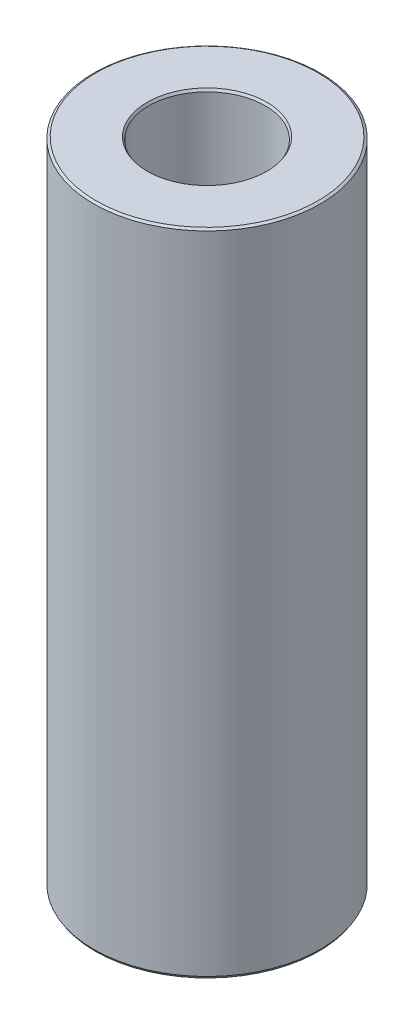
ISO-10303-21;
HEADER;
FILE_DESCRIPTION(('STEP AP214'),'2;1');
FILE_NAME('part.step','',(''),(''),'','','');
FILE_SCHEMA(('AUTOMOTIVE_DESIGN { 1 0 10303 214 1 1 1 1 }'));
ENDSEC;
DATA;
#1=APPLICATION_CONTEXT('core data for automotive mechanical design processes');
#2=APPLICATION_PROTOCOL_DEFINITION('international standard','automotive_design',2000,#1);
#3=PRODUCT_CONTEXT('',#1,'mechanical');
#4=PRODUCT('Part','Part','',(#3));
#5=PRODUCT_RELATED_PRODUCT_CATEGORY('part','',(#4));
#6=PRODUCT_DEFINITION_FORMATION('','',#4);
#7=PRODUCT_DEFINITION_CONTEXT('part definition',#1,'design');
#8=PRODUCT_DEFINITION('design','',#6,#7);
#9=PRODUCT_DEFINITION_SHAPE('','',#8);
#10=(LENGTH_UNIT() NAMED_UNIT(*) SI_UNIT(.MILLI.,.METRE.));
#11=(NAMED_UNIT(*) PLANE_ANGLE_UNIT() SI_UNIT($,.RADIAN.));
#12=(NAMED_UNIT(*) SI_UNIT($,.STERADIAN.) SOLID_ANGLE_UNIT());
#13=UNCERTAINTY_MEASURE_WITH_UNIT(LENGTH_MEASURE(1.E-05),#10,'distance_accuracy_value','');
#14=(GEOMETRIC_REPRESENTATION_CONTEXT(3) GLOBAL_UNCERTAINTY_ASSIGNED_CONTEXT((#13)) GLOBAL_UNIT_ASSIGNED_CONTEXT((#10,
#11,#12)) REPRESENTATION_CONTEXT('',''));
#15=CARTESIAN_POINT('',(0.,0.,0.));
#16=DIRECTION('',(0.,0.,1.));
#17=DIRECTION('',(1.,0.,0.));
#18=AXIS2_PLACEMENT_3D('',#15,#16,#17);
#19=CARTESIAN_POINT('',(0.,315.169408489033,0.));
#20=DIRECTION('',(0.,-1.,0.));
#21=DIRECTION('',(0.,0.,-1.));
#22=AXIS2_PLACEMENT_3D('',#19,#20,#21);
#23=CYLINDRICAL_SURFACE('',#22,55.);
#24=CARTESIAN_POINT('',(0.,1.15574677775504,0.));
#25=DIRECTION('',(0.,1.,0.));
#26=DIRECTION('',(0.,0.,1.));
#27=AXIS2_PLACEMENT_3D('',#24,#25,#26);
#28=CIRCLE('',#27,55.);
#29=CARTESIAN_POINT('',(0.,1.15574677775504,55.));
#30=VERTEX_POINT('',#29);
#31=EDGE_CURVE('E10',#30,#30,#28,.T.);
#32=ORIENTED_EDGE('',*,*,#31,.T.);
#33=EDGE_LOOP('',(#32));
#34=FACE_BOUND('',#33,.T.);
#35=CARTESIAN_POINT('',(0.,314.443020853433,0.));
#36=DIRECTION('',(0.,1.,0.));
#37=DIRECTION('',(0.,0.,1.));
#38=AXIS2_PLACEMENT_3D('',#35,#36,#37);
#39=CIRCLE('',#38,55.);
#40=CARTESIAN_POINT('',(0.,314.443020853433,55.));
#41=VERTEX_POINT('',#40);
#42=EDGE_CURVE('E50',#41,#41,#39,.F.);
#43=ORIENTED_EDGE('',*,*,#42,.T.);
#44=EDGE_LOOP('',(#43));
#45=FACE_BOUND('',#44,.T.);
#46=ADVANCED_FACE('F39',(#34,#45),#23,.T.);
#47=CARTESIAN_POINT('',(0.,315.169408489033,0.));
#48=DIRECTION('',(0.,1.,0.));
#49=DIRECTION('',(0.,0.,1.));
#50=AXIS2_PLACEMENT_3D('',#47,#48,#49);
#51=PLANE('',#50);
#52=CARTESIAN_POINT('',(0.,315.169408489033,0.));
#53=DIRECTION('',(0.,1.,0.));
#54=DIRECTION('',(0.,0.,1.));
#55=AXIS2_PLACEMENT_3D('',#52,#53,#54);
#56=CIRCLE('',#55,29.0378739717565);
#57=CARTESIAN_POINT('',(0.,315.169408489033,29.0378739717565));
#58=VERTEX_POINT('',#57);
#59=EDGE_CURVE('E58',#58,#58,#56,.F.);
#60=ORIENTED_EDGE('',*,*,#59,.T.);
#61=EDGE_LOOP('',(#60));
#62=FACE_BOUND('',#61,.T.);
#63=CARTESIAN_POINT('',(0.,315.169408489033,0.));
#64=DIRECTION('',(0.,1.,0.));
#65=DIRECTION('',(0.,0.,1.));
#66=AXIS2_PLACEMENT_3D('',#63,#64,#65);
#67=CIRCLE('',#66,53.844253222245);
#68=CARTESIAN_POINT('',(0.,315.169408489033,53.844253222245));
#69=VERTEX_POINT('',#68);
#70=EDGE_CURVE('E61',#69,#69,#67,.T.);
#71=ORIENTED_EDGE('',*,*,#70,.T.);
#72=EDGE_LOOP('',(#71));
#73=FACE_BOUND('',#72,.T.);
#74=ADVANCED_FACE('F88',(#62,#73),#51,.T.);
#75=CARTESIAN_POINT('',(0.,0.,0.));
#76=DIRECTION('',(0.,1.,0.));
#77=DIRECTION('',(0.,0.,1.));
#78=AXIS2_PLACEMENT_3D('',#75,#76,#77);
#79=PLANE('',#78);
#80=CARTESIAN_POINT('',(0.,0.,0.));
#81=DIRECTION('',(0.,1.,0.));
#82=DIRECTION('',(0.,0.,1.));
#83=AXIS2_PLACEMENT_3D('',#80,#81,#82);
#84=CIRCLE('',#83,29.4672331139111);
#85=CARTESIAN_POINT('',(0.,0.,29.4672331139111));
#86=VERTEX_POINT('',#85);
#87=EDGE_CURVE('E51',#86,#86,#84,.T.);
#88=ORIENTED_EDGE('',*,*,#87,.T.);
#89=EDGE_LOOP('',(#88));
#90=FACE_BOUND('',#89,.T.);
#91=CARTESIAN_POINT('',(0.,0.,0.));
#92=DIRECTION('',(0.,1.,0.));
#93=DIRECTION('',(0.,0.,1.));
#94=AXIS2_PLACEMENT_3D('',#91,#92,#93);
#95=CIRCLE('',#94,54.2736123643995);
#96=CARTESIAN_POINT('',(0.,0.,54.2736123643995));
#97=VERTEX_POINT('',#96);
#98=EDGE_CURVE('E54',#97,#97,#95,.F.);
#99=ORIENTED_EDGE('',*,*,#98,.T.);
#100=EDGE_LOOP('',(#99));
#101=FACE_BOUND('',#100,.T.);
#102=ADVANCED_FACE('F83',(#90,#101),#79,.F.);
#103=CARTESIAN_POINT('',(0.,315.169408489033,0.));
#104=DIRECTION('',(0.,-1.,0.));
#105=DIRECTION('',(0.,0.,-1.));
#106=AXIS2_PLACEMENT_3D('',#103,#104,#105);
#107=CYLINDRICAL_SURFACE('',#106,28.3114863361561);
#108=CARTESIAN_POINT('',(0.,314.013661711278,0.));
#109=DIRECTION('',(0.,1.,0.));
#110=DIRECTION('',(0.,0.,1.));
#111=AXIS2_PLACEMENT_3D('',#108,#109,#110);
#112=CIRCLE('',#111,28.3114863361561);
#113=CARTESIAN_POINT('',(0.,314.013661711278,28.3114863361561));
#114=VERTEX_POINT('',#113);
#115=EDGE_CURVE('E67',#114,#114,#112,.T.);
#116=ORIENTED_EDGE('',*,*,#115,.T.);
#117=EDGE_LOOP('',(#116));
#118=FACE_BOUND('',#117,.T.);
#119=CARTESIAN_POINT('',(0.,0.726387635600512,0.));
#120=DIRECTION('',(0.,1.,0.));
#121=DIRECTION('',(0.,0.,1.));
#122=AXIS2_PLACEMENT_3D('',#119,#120,#121);
#123=CIRCLE('',#122,28.3114863361561);
#124=CARTESIAN_POINT('',(0.,0.726387635600512,28.3114863361561));
#125=VERTEX_POINT('',#124);
#126=EDGE_CURVE('E69',#125,#125,#123,.F.);
#127=ORIENTED_EDGE('',*,*,#126,.T.);
#128=EDGE_LOOP('',(#127));
#129=FACE_BOUND('',#128,.T.);
#130=ADVANCED_FACE('F71',(#118,#129),#107,.F.);
#131=CARTESIAN_POINT('',(0.,314.013661711278,0.));
#132=DIRECTION('',(0.,1.,0.));
#133=DIRECTION('',(0.,0.,1.));
#134=AXIS2_PLACEMENT_3D('',#131,#132,#133);
#135=CONICAL_SURFACE('',#134,28.3114863361561,0.561112698481098);
#136=ORIENTED_EDGE('',*,*,#59,.F.);
#137=EDGE_LOOP('',(#136));
#138=FACE_BOUND('',#137,.T.);
#139=ORIENTED_EDGE('',*,*,#115,.F.);
#140=EDGE_LOOP('',(#139));
#141=FACE_BOUND('',#140,.T.);
#142=ADVANCED_FACE('F77',(#138,#141),#135,.F.);
#143=CARTESIAN_POINT('',(0.,0.,0.));
#144=DIRECTION('',(0.,-1.,0.));
#145=DIRECTION('',(0.,0.,-1.));
#146=AXIS2_PLACEMENT_3D('',#143,#144,#145);
#147=CONICAL_SURFACE('',#146,29.4672331139111,1.00968362831378);
#148=ORIENTED_EDGE('',*,*,#126,.F.);
#149=EDGE_LOOP('',(#148));
#150=FACE_BOUND('',#149,.T.);
#151=ORIENTED_EDGE('',*,*,#87,.F.);
#152=EDGE_LOOP('',(#151));
#153=FACE_BOUND('',#152,.T.);
#154=ADVANCED_FACE('F73',(#150,#153),#147,.F.);
#155=CARTESIAN_POINT('',(0.,1.15574677775504,0.));
#156=DIRECTION('',(0.,1.,0.));
#157=DIRECTION('',(0.,0.,1.));
#158=AXIS2_PLACEMENT_3D('',#155,#156,#157);
#159=CONICAL_SURFACE('',#158,55.,0.561112698481115);
#160=ORIENTED_EDGE('',*,*,#98,.F.);
#161=EDGE_LOOP('',(#160));
#162=FACE_BOUND('',#161,.T.);
#163=ORIENTED_EDGE('',*,*,#31,.F.);
#164=EDGE_LOOP('',(#163));
#165=FACE_BOUND('',#164,.T.);
#166=ADVANCED_FACE('F76',(#162,#165),#159,.T.);
#167=CARTESIAN_POINT('',(0.,315.169408489033,0.));
#168=DIRECTION('',(0.,-1.,0.));
#169=DIRECTION('',(0.,0.,-1.));
#170=AXIS2_PLACEMENT_3D('',#167,#168,#169);
#171=CONICAL_SURFACE('',#170,53.844253222245,1.00968362831378);
#172=ORIENTED_EDGE('',*,*,#42,.F.);
#173=EDGE_LOOP('',(#172));
#174=FACE_BOUND('',#173,.T.);
#175=ORIENTED_EDGE('',*,*,#70,.F.);
#176=EDGE_LOOP('',(#175));
#177=FACE_BOUND('',#176,.T.);
#178=ADVANCED_FACE('F45',(#174,#177),#171,.T.);
#179=CLOSED_SHELL('',(#46,#74,#102,#130,#142,#154,#166,#178));
#180=MANIFOLD_SOLID_BREP('B2',#179);
#181=ADVANCED_BREP_SHAPE_REPRESENTATION('',(#18,#180),#14);
#182=SHAPE_DEFINITION_REPRESENTATION(#9,#181);
ENDSEC;
END-ISO-10303-21;
